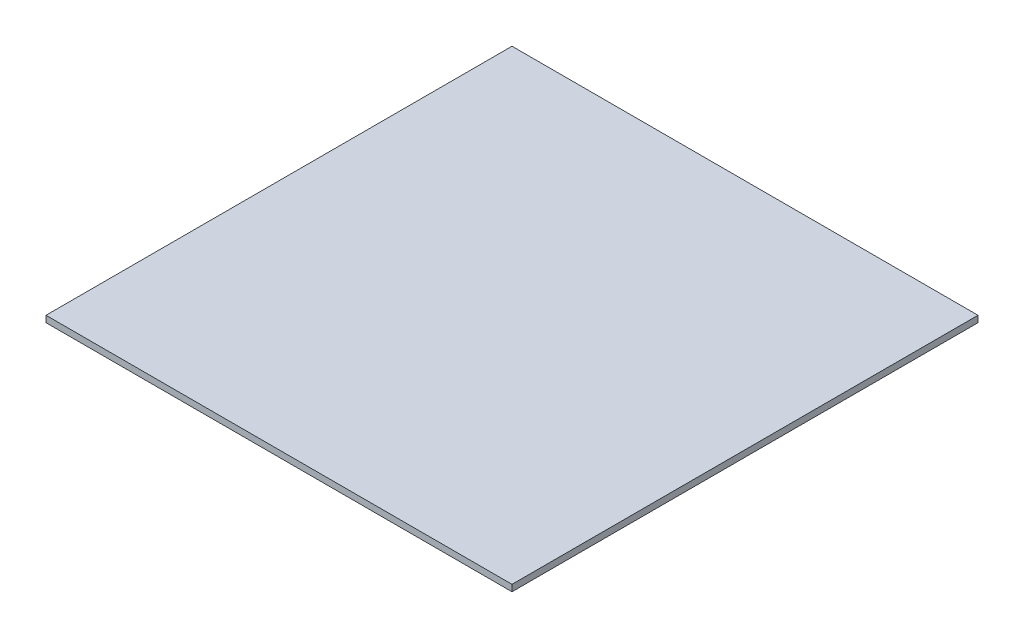
ISO-10303-21;
HEADER;
FILE_DESCRIPTION(('STEP AP214'),'2;1');
FILE_NAME('part.step','',(''),(''),'','','');
FILE_SCHEMA(('AUTOMOTIVE_DESIGN { 1 0 10303 214 1 1 1 1 }'));
ENDSEC;
DATA;
#1=APPLICATION_CONTEXT('core data for automotive mechanical design processes');
#2=APPLICATION_PROTOCOL_DEFINITION('international standard','automotive_design',2000,#1);
#3=PRODUCT_CONTEXT('',#1,'mechanical');
#4=PRODUCT('Part','Part','',(#3));
#5=PRODUCT_RELATED_PRODUCT_CATEGORY('part','',(#4));
#6=PRODUCT_DEFINITION_FORMATION('','',#4);
#7=PRODUCT_DEFINITION_CONTEXT('part definition',#1,'design');
#8=PRODUCT_DEFINITION('design','',#6,#7);
#9=PRODUCT_DEFINITION_SHAPE('','',#8);
#10=(LENGTH_UNIT() NAMED_UNIT(*) SI_UNIT(.MILLI.,.METRE.));
#11=(NAMED_UNIT(*) PLANE_ANGLE_UNIT() SI_UNIT($,.RADIAN.));
#12=(NAMED_UNIT(*) SI_UNIT($,.STERADIAN.) SOLID_ANGLE_UNIT());
#13=UNCERTAINTY_MEASURE_WITH_UNIT(LENGTH_MEASURE(1.E-05),#10,'distance_accuracy_value','');
#14=(GEOMETRIC_REPRESENTATION_CONTEXT(3) GLOBAL_UNCERTAINTY_ASSIGNED_CONTEXT((#13)) GLOBAL_UNIT_ASSIGNED_CONTEXT((#10,
#11,#12)) REPRESENTATION_CONTEXT('',''));
#15=CARTESIAN_POINT('',(0.,0.,0.));
#16=DIRECTION('',(0.,0.,1.));
#17=DIRECTION('',(1.,0.,0.));
#18=AXIS2_PLACEMENT_3D('',#15,#16,#17);
#19=CARTESIAN_POINT('',(228.6,6.35,-228.6));
#20=DIRECTION('',(-1.,0.,0.));
#21=DIRECTION('',(0.,0.,1.));
#22=AXIS2_PLACEMENT_3D('',#19,#20,#21);
#23=PLANE('',#22);
#24=DIRECTION('',(0.,0.,-1.));
#25=VECTOR('',#24,1.);
#26=CARTESIAN_POINT('',(228.6,0.,-228.6));
#27=LINE('',#26,#25);
#28=CARTESIAN_POINT('',(228.6,0.,228.6));
#29=VERTEX_POINT('',#28);
#30=CARTESIAN_POINT('',(228.6,0.,-228.6));
#31=VERTEX_POINT('',#30);
#32=EDGE_CURVE('E96',#29,#31,#27,.T.);
#33=ORIENTED_EDGE('',*,*,#32,.T.);
#34=DIRECTION('',(0.,-1.,0.));
#35=VECTOR('',#34,1.);
#36=CARTESIAN_POINT('',(228.6,6.35,-228.6));
#37=LINE('',#36,#35);
#38=CARTESIAN_POINT('',(228.6,6.35,-228.6));
#39=VERTEX_POINT('',#38);
#40=EDGE_CURVE('E11',#39,#31,#37,.T.);
#41=ORIENTED_EDGE('',*,*,#40,.F.);
#42=DIRECTION('',(0.,0.,-1.));
#43=VECTOR('',#42,1.);
#44=CARTESIAN_POINT('',(228.6,6.35,-228.6));
#45=LINE('',#44,#43);
#46=CARTESIAN_POINT('',(228.6,6.35,228.6));
#47=VERTEX_POINT('',#46);
#48=EDGE_CURVE('E84',#47,#39,#45,.T.);
#49=ORIENTED_EDGE('',*,*,#48,.F.);
#50=DIRECTION('',(0.,-1.,0.));
#51=VECTOR('',#50,1.);
#52=CARTESIAN_POINT('',(228.6,6.35,228.6));
#53=LINE('',#52,#51);
#54=EDGE_CURVE('E92',#47,#29,#53,.T.);
#55=ORIENTED_EDGE('',*,*,#54,.T.);
#56=EDGE_LOOP('',(#33,#41,#49,#55));
#57=FACE_BOUND('',#56,.T.);
#58=ADVANCED_FACE('F33',(#57),#23,.F.);
#59=CARTESIAN_POINT('',(-228.6,6.35,-228.6));
#60=DIRECTION('',(0.,0.,1.));
#61=DIRECTION('',(1.,0.,0.));
#62=AXIS2_PLACEMENT_3D('',#59,#60,#61);
#63=PLANE('',#62);
#64=DIRECTION('',(-1.,0.,0.));
#65=VECTOR('',#64,1.);
#66=CARTESIAN_POINT('',(-228.6,0.,-228.6));
#67=LINE('',#66,#65);
#68=CARTESIAN_POINT('',(-228.6,0.,-228.6));
#69=VERTEX_POINT('',#68);
#70=EDGE_CURVE('E88',#31,#69,#67,.T.);
#71=ORIENTED_EDGE('',*,*,#70,.T.);
#72=DIRECTION('',(0.,-1.,0.));
#73=VECTOR('',#72,1.);
#74=CARTESIAN_POINT('',(-228.6,6.35,-228.6));
#75=LINE('',#74,#73);
#76=CARTESIAN_POINT('',(-228.6,6.35,-228.6));
#77=VERTEX_POINT('',#76);
#78=EDGE_CURVE('E41',#77,#69,#75,.T.);
#79=ORIENTED_EDGE('',*,*,#78,.F.);
#80=DIRECTION('',(-1.,0.,0.));
#81=VECTOR('',#80,1.);
#82=CARTESIAN_POINT('',(-228.6,6.35,-228.6));
#83=LINE('',#82,#81);
#84=EDGE_CURVE('E79',#39,#77,#83,.T.);
#85=ORIENTED_EDGE('',*,*,#84,.F.);
#86=ORIENTED_EDGE('',*,*,#40,.T.);
#87=EDGE_LOOP('',(#71,#79,#85,#86));
#88=FACE_BOUND('',#87,.T.);
#89=ADVANCED_FACE('F87',(#88),#63,.F.);
#90=CARTESIAN_POINT('',(-228.6,6.35,-228.6));
#91=DIRECTION('',(1.,0.,0.));
#92=DIRECTION('',(0.,0.,-1.));
#93=AXIS2_PLACEMENT_3D('',#90,#91,#92);
#94=PLANE('',#93);
#95=DIRECTION('',(0.,0.,1.));
#96=VECTOR('',#95,1.);
#97=CARTESIAN_POINT('',(-228.6,0.,-228.6));
#98=LINE('',#97,#96);
#99=CARTESIAN_POINT('',(-228.6,0.,228.6));
#100=VERTEX_POINT('',#99);
#101=EDGE_CURVE('E66',#69,#100,#98,.T.);
#102=ORIENTED_EDGE('',*,*,#101,.T.);
#103=DIRECTION('',(0.,-1.,0.));
#104=VECTOR('',#103,1.);
#105=CARTESIAN_POINT('',(-228.6,6.35,228.6));
#106=LINE('',#105,#104);
#107=CARTESIAN_POINT('',(-228.6,6.35,228.6));
#108=VERTEX_POINT('',#107);
#109=EDGE_CURVE('E89',#108,#100,#106,.T.);
#110=ORIENTED_EDGE('',*,*,#109,.F.);
#111=DIRECTION('',(0.,0.,1.));
#112=VECTOR('',#111,1.);
#113=CARTESIAN_POINT('',(-228.6,6.35,-228.6));
#114=LINE('',#113,#112);
#115=EDGE_CURVE('E82',#77,#108,#114,.T.);
#116=ORIENTED_EDGE('',*,*,#115,.F.);
#117=ORIENTED_EDGE('',*,*,#78,.T.);
#118=EDGE_LOOP('',(#102,#110,#116,#117));
#119=FACE_BOUND('',#118,.T.);
#120=ADVANCED_FACE('F90',(#119),#94,.F.);
#121=CARTESIAN_POINT('',(-228.6,6.35,228.6));
#122=DIRECTION('',(0.,0.,-1.));
#123=DIRECTION('',(-1.,0.,0.));
#124=AXIS2_PLACEMENT_3D('',#121,#122,#123);
#125=PLANE('',#124);
#126=DIRECTION('',(1.,0.,0.));
#127=VECTOR('',#126,1.);
#128=CARTESIAN_POINT('',(-228.6,0.,228.6));
#129=LINE('',#128,#127);
#130=EDGE_CURVE('E72',#100,#29,#129,.T.);
#131=ORIENTED_EDGE('',*,*,#130,.T.);
#132=ORIENTED_EDGE('',*,*,#54,.F.);
#133=DIRECTION('',(1.,0.,0.));
#134=VECTOR('',#133,1.);
#135=CARTESIAN_POINT('',(-228.6,6.35,228.6));
#136=LINE('',#135,#134);
#137=EDGE_CURVE('E49',#108,#47,#136,.T.);
#138=ORIENTED_EDGE('',*,*,#137,.F.);
#139=ORIENTED_EDGE('',*,*,#109,.T.);
#140=EDGE_LOOP('',(#131,#132,#138,#139));
#141=FACE_BOUND('',#140,.T.);
#142=ADVANCED_FACE('F103',(#141),#125,.F.);
#143=CARTESIAN_POINT('',(0.,6.35,0.));
#144=DIRECTION('',(0.,1.,0.));
#145=DIRECTION('',(0.,0.,1.));
#146=AXIS2_PLACEMENT_3D('',#143,#144,#145);
#147=PLANE('',#146);
#148=ORIENTED_EDGE('',*,*,#48,.T.);
#149=ORIENTED_EDGE('',*,*,#84,.T.);
#150=ORIENTED_EDGE('',*,*,#115,.T.);
#151=ORIENTED_EDGE('',*,*,#137,.T.);
#152=EDGE_LOOP('',(#148,#149,#150,#151));
#153=FACE_BOUND('',#152,.T.);
#154=ADVANCED_FACE('F80',(#153),#147,.T.);
#155=CARTESIAN_POINT('',(0.,0.,0.));
#156=DIRECTION('',(0.,1.,0.));
#157=DIRECTION('',(0.,0.,1.));
#158=AXIS2_PLACEMENT_3D('',#155,#156,#157);
#159=PLANE('',#158);
#160=ORIENTED_EDGE('',*,*,#32,.F.);
#161=ORIENTED_EDGE('',*,*,#130,.F.);
#162=ORIENTED_EDGE('',*,*,#101,.F.);
#163=ORIENTED_EDGE('',*,*,#70,.F.);
#164=EDGE_LOOP('',(#160,#161,#162,#163));
#165=FACE_BOUND('',#164,.T.);
#166=ADVANCED_FACE('F106',(#165),#159,.F.);
#167=CLOSED_SHELL('',(#58,#89,#120,#142,#154,#166));
#168=MANIFOLD_SOLID_BREP('B2',#167);
#169=ADVANCED_BREP_SHAPE_REPRESENTATION('',(#18,#168),#14);
#170=SHAPE_DEFINITION_REPRESENTATION(#9,#169);
ENDSEC;
END-ISO-10303-21;
